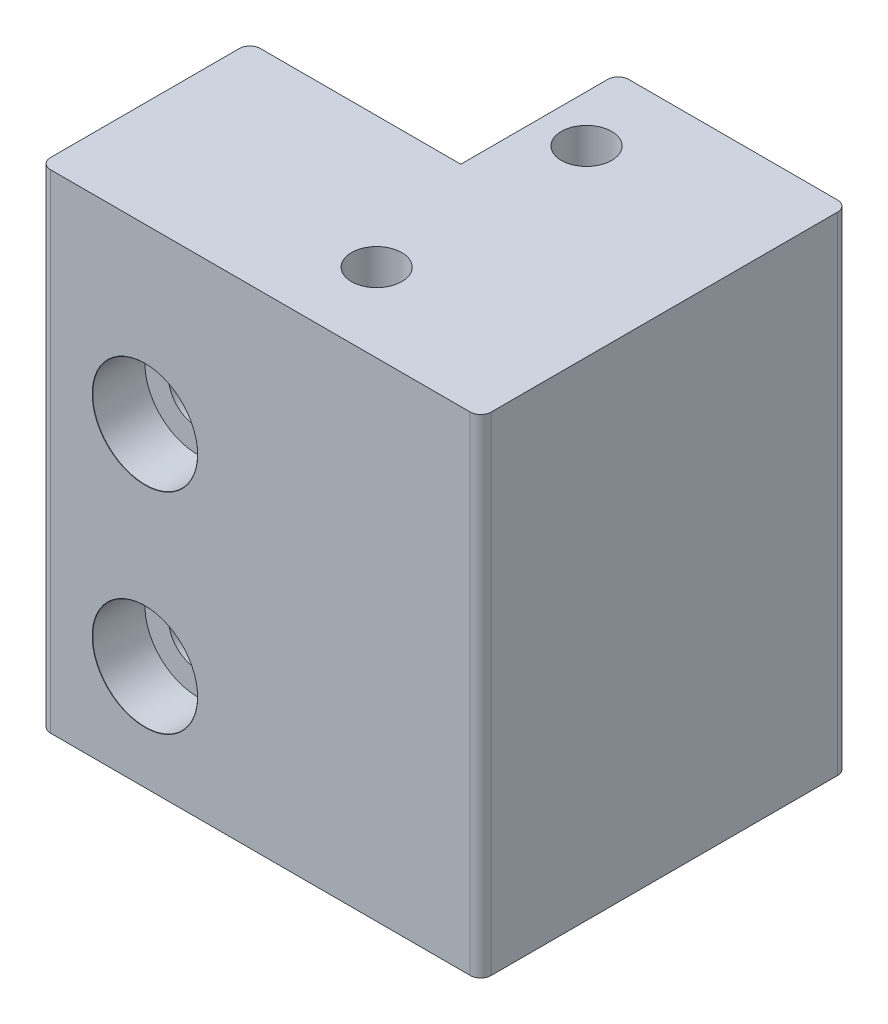
ISO-10303-21;
HEADER;
FILE_DESCRIPTION(('STEP AP214'),'2;1');
FILE_NAME('part.step','',(''),(''),'','','');
FILE_SCHEMA(('AUTOMOTIVE_DESIGN { 1 0 10303 214 1 1 1 1 }'));
ENDSEC;
DATA;
#1=APPLICATION_CONTEXT('core data for automotive mechanical design processes');
#2=APPLICATION_PROTOCOL_DEFINITION('international standard','automotive_design',2000,#1);
#3=PRODUCT_CONTEXT('',#1,'mechanical');
#4=PRODUCT('Part','Part','',(#3));
#5=PRODUCT_RELATED_PRODUCT_CATEGORY('part','',(#4));
#6=PRODUCT_DEFINITION_FORMATION('','',#4);
#7=PRODUCT_DEFINITION_CONTEXT('part definition',#1,'design');
#8=PRODUCT_DEFINITION('design','',#6,#7);
#9=PRODUCT_DEFINITION_SHAPE('','',#8);
#10=(LENGTH_UNIT() NAMED_UNIT(*) SI_UNIT(.MILLI.,.METRE.));
#11=(NAMED_UNIT(*) PLANE_ANGLE_UNIT() SI_UNIT($,.RADIAN.));
#12=(NAMED_UNIT(*) SI_UNIT($,.STERADIAN.) SOLID_ANGLE_UNIT());
#13=UNCERTAINTY_MEASURE_WITH_UNIT(LENGTH_MEASURE(1.E-05),#10,'distance_accuracy_value','');
#14=(GEOMETRIC_REPRESENTATION_CONTEXT(3) GLOBAL_UNCERTAINTY_ASSIGNED_CONTEXT((#13)) GLOBAL_UNIT_ASSIGNED_CONTEXT((#10,
#11,#12)) REPRESENTATION_CONTEXT('',''));
#15=CARTESIAN_POINT('',(0.,0.,0.));
#16=DIRECTION('',(0.,0.,1.));
#17=DIRECTION('',(1.,0.,0.));
#18=AXIS2_PLACEMENT_3D('',#15,#16,#17);
#19=CARTESIAN_POINT('',(21.,40.,-10.));
#20=DIRECTION('',(0.,0.,1.));
#21=DIRECTION('',(1.,0.,0.));
#22=AXIS2_PLACEMENT_3D('',#19,#20,#21);
#23=PLANE('',#22);
#24=CARTESIAN_POINT('',(-11.,30.,-10.));
#25=DIRECTION('',(0.,0.,1.));
#26=DIRECTION('',(1.,0.,0.));
#27=AXIS2_PLACEMENT_3D('',#24,#25,#26);
#28=CIRCLE('',#27,2.74999999999999);
#29=CARTESIAN_POINT('',(-8.25,30.,-10.));
#30=VERTEX_POINT('',#29);
#31=EDGE_CURVE('E179',#30,#30,#28,.T.);
#32=ORIENTED_EDGE('',*,*,#31,.T.);
#33=EDGE_LOOP('',(#32));
#34=FACE_BOUND('',#33,.T.);
#35=CARTESIAN_POINT('',(-11.,10.,-10.));
#36=DIRECTION('',(0.,0.,1.));
#37=DIRECTION('',(1.,0.,0.));
#38=AXIS2_PLACEMENT_3D('',#35,#36,#37);
#39=CIRCLE('',#38,2.74999999999999);
#40=CARTESIAN_POINT('',(-8.25,10.,-10.));
#41=VERTEX_POINT('',#40);
#42=EDGE_CURVE('E192',#41,#41,#39,.T.);
#43=ORIENTED_EDGE('',*,*,#42,.T.);
#44=EDGE_LOOP('',(#43));
#45=FACE_BOUND('',#44,.T.);
#46=DIRECTION('',(-1.,0.,0.));
#47=VECTOR('',#46,1.);
#48=CARTESIAN_POINT('',(21.,0.,-10.));
#49=LINE('',#48,#47);
#50=CARTESIAN_POINT('',(-0.900000000000001,0.,-10.));
#51=VERTEX_POINT('',#50);
#52=CARTESIAN_POINT('',(-20.,0.,-10.));
#53=VERTEX_POINT('',#52);
#54=EDGE_CURVE('E204',#51,#53,#49,.T.);
#55=ORIENTED_EDGE('',*,*,#54,.T.);
#56=DIRECTION('',(0.,-1.,0.));
#57=VECTOR('',#56,1.);
#58=CARTESIAN_POINT('',(-20.,40.,-10.));
#59=LINE('',#58,#57);
#60=CARTESIAN_POINT('',(-20.,46.5,-10.));
#61=VERTEX_POINT('',#60);
#62=EDGE_CURVE('E11',#53,#61,#59,.F.);
#63=ORIENTED_EDGE('',*,*,#62,.T.);
#64=DIRECTION('',(-1.,0.,0.));
#65=VECTOR('',#64,1.);
#66=CARTESIAN_POINT('',(-0.900000000000001,46.5,-10.));
#67=LINE('',#66,#65);
#68=CARTESIAN_POINT('',(-0.900000000000001,46.5,-10.));
#69=VERTEX_POINT('',#68);
#70=EDGE_CURVE('E130',#69,#61,#67,.T.);
#71=ORIENTED_EDGE('',*,*,#70,.F.);
#72=DIRECTION('',(0.,1.,0.));
#73=VECTOR('',#72,1.);
#74=CARTESIAN_POINT('',(-0.900000000000001,-26.5444909538684,-10.));
#75=LINE('',#74,#73);
#76=EDGE_CURVE('E139',#51,#69,#75,.T.);
#77=ORIENTED_EDGE('',*,*,#76,.F.);
#78=EDGE_LOOP('',(#55,#63,#71,#77));
#79=FACE_BOUND('',#78,.T.);
#80=ADVANCED_FACE('F41',(#34,#45,#79),#23,.F.);
#81=CARTESIAN_POINT('',(-21.,40.,-10.));
#82=DIRECTION('',(1.,0.,0.));
#83=DIRECTION('',(0.,0.,-1.));
#84=AXIS2_PLACEMENT_3D('',#81,#82,#83);
#85=PLANE('',#84);
#86=DIRECTION('',(0.,0.,1.));
#87=VECTOR('',#86,1.);
#88=CARTESIAN_POINT('',(-21.,46.5,-10.));
#89=LINE('',#88,#87);
#90=CARTESIAN_POINT('',(-21.,46.5,-9.));
#91=VERTEX_POINT('',#90);
#92=CARTESIAN_POINT('',(-21.,46.5,9.));
#93=VERTEX_POINT('',#92);
#94=EDGE_CURVE('E149',#91,#93,#89,.T.);
#95=ORIENTED_EDGE('',*,*,#94,.F.);
#96=DIRECTION('',(0.,-1.,0.));
#97=VECTOR('',#96,1.);
#98=CARTESIAN_POINT('',(-21.,40.,-9.));
#99=LINE('',#98,#97);
#100=CARTESIAN_POINT('',(-21.,0.,-9.));
#101=VERTEX_POINT('',#100);
#102=EDGE_CURVE('E49',#91,#101,#99,.T.);
#103=ORIENTED_EDGE('',*,*,#102,.T.);
#104=DIRECTION('',(0.,0.,1.));
#105=VECTOR('',#104,1.);
#106=CARTESIAN_POINT('',(-21.,0.,-10.));
#107=LINE('',#106,#105);
#108=CARTESIAN_POINT('',(-21.,0.,9.));
#109=VERTEX_POINT('',#108);
#110=EDGE_CURVE('E146',#101,#109,#107,.T.);
#111=ORIENTED_EDGE('',*,*,#110,.T.);
#112=DIRECTION('',(0.,-1.,0.));
#113=VECTOR('',#112,1.);
#114=CARTESIAN_POINT('',(-21.,40.,9.));
#115=LINE('',#114,#113);
#116=EDGE_CURVE('E244',#109,#93,#115,.F.);
#117=ORIENTED_EDGE('',*,*,#116,.T.);
#118=EDGE_LOOP('',(#95,#103,#111,#117));
#119=FACE_BOUND('',#118,.T.);
#120=ADVANCED_FACE('F250',(#119),#85,.F.);
#121=CARTESIAN_POINT('',(21.,40.,10.));
#122=DIRECTION('',(0.,0.,-1.));
#123=DIRECTION('',(-1.,0.,0.));
#124=AXIS2_PLACEMENT_3D('',#121,#122,#123);
#125=PLANE('',#124);
#126=CARTESIAN_POINT('',(-11.,30.,10.));
#127=DIRECTION('',(0.,0.,1.));
#128=DIRECTION('',(1.,0.,0.));
#129=AXIS2_PLACEMENT_3D('',#126,#127,#128);
#130=CIRCLE('',#129,5.025);
#131=CARTESIAN_POINT('',(-5.975,30.,10.));
#132=VERTEX_POINT('',#131);
#133=EDGE_CURVE('E135',#132,#132,#130,.T.);
#134=ORIENTED_EDGE('',*,*,#133,.F.);
#135=EDGE_LOOP('',(#134));
#136=FACE_BOUND('',#135,.T.);
#137=CARTESIAN_POINT('',(-11.,10.,10.));
#138=DIRECTION('',(0.,0.,1.));
#139=DIRECTION('',(1.,0.,0.));
#140=AXIS2_PLACEMENT_3D('',#137,#138,#139);
#141=CIRCLE('',#140,5.025);
#142=CARTESIAN_POINT('',(-5.975,10.,10.));
#143=VERTEX_POINT('',#142);
#144=EDGE_CURVE('E180',#143,#143,#141,.T.);
#145=ORIENTED_EDGE('',*,*,#144,.F.);
#146=EDGE_LOOP('',(#145));
#147=FACE_BOUND('',#146,.T.);
#148=DIRECTION('',(1.,0.,0.));
#149=VECTOR('',#148,1.);
#150=CARTESIAN_POINT('',(21.,0.,10.));
#151=LINE('',#150,#149);
#152=CARTESIAN_POINT('',(-20.,0.,10.));
#153=VERTEX_POINT('',#152);
#154=CARTESIAN_POINT('',(20.,0.,10.));
#155=VERTEX_POINT('',#154);
#156=EDGE_CURVE('E199',#153,#155,#151,.T.);
#157=ORIENTED_EDGE('',*,*,#156,.T.);
#158=DIRECTION('',(0.,-1.,0.));
#159=VECTOR('',#158,1.);
#160=CARTESIAN_POINT('',(20.,40.,10.));
#161=LINE('',#160,#159);
#162=CARTESIAN_POINT('',(20.,46.5,10.));
#163=VERTEX_POINT('',#162);
#164=EDGE_CURVE('E242',#155,#163,#161,.F.);
#165=ORIENTED_EDGE('',*,*,#164,.T.);
#166=DIRECTION('',(1.,0.,0.));
#167=VECTOR('',#166,1.);
#168=CARTESIAN_POINT('',(-21.,46.5,10.));
#169=LINE('',#168,#167);
#170=CARTESIAN_POINT('',(-20.,46.5,10.));
#171=VERTEX_POINT('',#170);
#172=EDGE_CURVE('E153',#171,#163,#169,.T.);
#173=ORIENTED_EDGE('',*,*,#172,.F.);
#174=DIRECTION('',(0.,-1.,0.));
#175=VECTOR('',#174,1.);
#176=CARTESIAN_POINT('',(-20.,40.,10.));
#177=LINE('',#176,#175);
#178=EDGE_CURVE('E240',#171,#153,#177,.T.);
#179=ORIENTED_EDGE('',*,*,#178,.T.);
#180=EDGE_LOOP('',(#157,#165,#173,#179));
#181=FACE_BOUND('',#180,.T.);
#182=ADVANCED_FACE('F255',(#136,#147,#181),#125,.F.);
#183=CARTESIAN_POINT('',(21.,40.,-10.));
#184=DIRECTION('',(-1.,0.,0.));
#185=DIRECTION('',(0.,0.,1.));
#186=AXIS2_PLACEMENT_3D('',#183,#184,#185);
#187=PLANE('',#186);
#188=DIRECTION('',(0.,0.,-1.));
#189=VECTOR('',#188,1.);
#190=CARTESIAN_POINT('',(21.,0.,-10.));
#191=LINE('',#190,#189);
#192=CARTESIAN_POINT('',(21.,0.,9.));
#193=VERTEX_POINT('',#192);
#194=CARTESIAN_POINT('',(21.,0.,-24.));
#195=VERTEX_POINT('',#194);
#196=EDGE_CURVE('E201',#193,#195,#191,.T.);
#197=ORIENTED_EDGE('',*,*,#196,.T.);
#198=DIRECTION('',(0.,1.,0.));
#199=VECTOR('',#198,1.);
#200=CARTESIAN_POINT('',(21.,46.5,-24.));
#201=LINE('',#200,#199);
#202=CARTESIAN_POINT('',(21.,46.5,-24.));
#203=VERTEX_POINT('',#202);
#204=EDGE_CURVE('E237',#195,#203,#201,.T.);
#205=ORIENTED_EDGE('',*,*,#204,.T.);
#206=DIRECTION('',(0.,0.,-1.));
#207=VECTOR('',#206,1.);
#208=CARTESIAN_POINT('',(21.,46.5,10.));
#209=LINE('',#208,#207);
#210=CARTESIAN_POINT('',(21.,46.5,9.));
#211=VERTEX_POINT('',#210);
#212=EDGE_CURVE('E164',#211,#203,#209,.T.);
#213=ORIENTED_EDGE('',*,*,#212,.F.);
#214=DIRECTION('',(0.,-1.,0.));
#215=VECTOR('',#214,1.);
#216=CARTESIAN_POINT('',(21.,40.,9.));
#217=LINE('',#216,#215);
#218=EDGE_CURVE('E234',#211,#193,#217,.T.);
#219=ORIENTED_EDGE('',*,*,#218,.T.);
#220=EDGE_LOOP('',(#197,#205,#213,#219));
#221=FACE_BOUND('',#220,.T.);
#222=ADVANCED_FACE('F263',(#221),#187,.F.);
#223=CARTESIAN_POINT('',(0.,0.,0.));
#224=DIRECTION('',(0.,-1.,0.));
#225=DIRECTION('',(0.,0.,-1.));
#226=AXIS2_PLACEMENT_3D('',#223,#224,#225);
#227=PLANE('',#226);
#228=DIRECTION('',(0.,0.,1.));
#229=VECTOR('',#228,1.);
#230=CARTESIAN_POINT('',(-0.900000000000001,0.,-10.));
#231=LINE('',#230,#229);
#232=CARTESIAN_POINT('',(-0.900000000000001,0.,-24.));
#233=VERTEX_POINT('',#232);
#234=EDGE_CURVE('E142',#233,#51,#231,.T.);
#235=ORIENTED_EDGE('',*,*,#234,.F.);
#236=CARTESIAN_POINT('',(0.0999999999999994,0.,-24.));
#237=DIRECTION('',(0.,-1.,0.));
#238=DIRECTION('',(0.,0.,-1.));
#239=AXIS2_PLACEMENT_3D('',#236,#237,#238);
#240=CIRCLE('',#239,1.);
#241=CARTESIAN_POINT('',(0.0999999999999994,0.,-25.));
#242=VERTEX_POINT('',#241);
#243=EDGE_CURVE('E232',#233,#242,#240,.T.);
#244=ORIENTED_EDGE('',*,*,#243,.T.);
#245=DIRECTION('',(-1.,0.,0.));
#246=VECTOR('',#245,1.);
#247=CARTESIAN_POINT('',(21.,0.,-25.));
#248=LINE('',#247,#246);
#249=CARTESIAN_POINT('',(20.,0.,-25.));
#250=VERTEX_POINT('',#249);
#251=EDGE_CURVE('E193',#250,#242,#248,.T.);
#252=ORIENTED_EDGE('',*,*,#251,.F.);
#253=CARTESIAN_POINT('',(20.,0.,-24.));
#254=DIRECTION('',(0.,-1.,0.));
#255=DIRECTION('',(0.,0.,-1.));
#256=AXIS2_PLACEMENT_3D('',#253,#254,#255);
#257=CIRCLE('',#256,1.);
#258=EDGE_CURVE('E230',#250,#195,#257,.T.);
#259=ORIENTED_EDGE('',*,*,#258,.T.);
#260=ORIENTED_EDGE('',*,*,#196,.F.);
#261=CARTESIAN_POINT('',(20.,0.,9.));
#262=DIRECTION('',(0.,-1.,0.));
#263=DIRECTION('',(0.,0.,-1.));
#264=AXIS2_PLACEMENT_3D('',#261,#262,#263);
#265=CIRCLE('',#264,1.);
#266=EDGE_CURVE('E56',#193,#155,#265,.T.);
#267=ORIENTED_EDGE('',*,*,#266,.T.);
#268=ORIENTED_EDGE('',*,*,#156,.F.);
#269=CARTESIAN_POINT('',(-20.,0.,9.));
#270=DIRECTION('',(0.,-1.,0.));
#271=DIRECTION('',(0.,0.,-1.));
#272=AXIS2_PLACEMENT_3D('',#269,#270,#271);
#273=CIRCLE('',#272,1.);
#274=EDGE_CURVE('E64',#153,#109,#273,.T.);
#275=ORIENTED_EDGE('',*,*,#274,.T.);
#276=ORIENTED_EDGE('',*,*,#110,.F.);
#277=CARTESIAN_POINT('',(-20.,0.,-9.));
#278=DIRECTION('',(0.,-1.,0.));
#279=DIRECTION('',(0.,0.,-1.));
#280=AXIS2_PLACEMENT_3D('',#277,#278,#279);
#281=CIRCLE('',#280,1.);
#282=EDGE_CURVE('E227',#101,#53,#281,.T.);
#283=ORIENTED_EDGE('',*,*,#282,.T.);
#284=ORIENTED_EDGE('',*,*,#54,.F.);
#285=EDGE_LOOP('',(#235,#244,#252,#259,#260,#267,#268,#275,#276,#283,#284));
#286=FACE_BOUND('',#285,.T.);
#287=ADVANCED_FACE('F252',(#286),#227,.T.);
#288=CARTESIAN_POINT('',(21.,-26.5444909538684,-25.));
#289=DIRECTION('',(0.,0.,-1.));
#290=DIRECTION('',(-1.,0.,0.));
#291=AXIS2_PLACEMENT_3D('',#288,#289,#290);
#292=PLANE('',#291);
#293=ORIENTED_EDGE('',*,*,#251,.T.);
#294=DIRECTION('',(0.,1.,0.));
#295=VECTOR('',#294,1.);
#296=CARTESIAN_POINT('',(0.0999999999999994,-26.5444909538684,-25.));
#297=LINE('',#296,#295);
#298=CARTESIAN_POINT('',(0.0999999999999994,46.5,-25.));
#299=VERTEX_POINT('',#298);
#300=EDGE_CURVE('E212',#242,#299,#297,.T.);
#301=ORIENTED_EDGE('',*,*,#300,.T.);
#302=DIRECTION('',(-1.,0.,0.));
#303=VECTOR('',#302,1.);
#304=CARTESIAN_POINT('',(21.,46.5,-25.));
#305=LINE('',#304,#303);
#306=CARTESIAN_POINT('',(20.,46.5,-25.));
#307=VERTEX_POINT('',#306);
#308=EDGE_CURVE('E136',#307,#299,#305,.T.);
#309=ORIENTED_EDGE('',*,*,#308,.F.);
#310=DIRECTION('',(0.,1.,0.));
#311=VECTOR('',#310,1.);
#312=CARTESIAN_POINT('',(20.,0.,-25.));
#313=LINE('',#312,#311);
#314=EDGE_CURVE('E206',#307,#250,#313,.F.);
#315=ORIENTED_EDGE('',*,*,#314,.T.);
#316=EDGE_LOOP('',(#293,#301,#309,#315));
#317=FACE_BOUND('',#316,.T.);
#318=ADVANCED_FACE('F271',(#317),#292,.T.);
#319=CARTESIAN_POINT('',(-0.900000000000001,-26.5444909538684,-10.));
#320=DIRECTION('',(-1.,0.,0.));
#321=DIRECTION('',(0.,0.,1.));
#322=AXIS2_PLACEMENT_3D('',#319,#320,#321);
#323=PLANE('',#322);
#324=DIRECTION('',(0.,0.,1.));
#325=VECTOR('',#324,1.);
#326=CARTESIAN_POINT('',(-0.900000000000001,46.5,-25.));
#327=LINE('',#326,#325);
#328=CARTESIAN_POINT('',(-0.900000000000001,46.5,-24.));
#329=VERTEX_POINT('',#328);
#330=EDGE_CURVE('E125',#329,#69,#327,.T.);
#331=ORIENTED_EDGE('',*,*,#330,.F.);
#332=DIRECTION('',(0.,1.,0.));
#333=VECTOR('',#332,1.);
#334=CARTESIAN_POINT('',(-0.900000000000001,-26.5444909538684,-24.));
#335=LINE('',#334,#333);
#336=EDGE_CURVE('E224',#329,#233,#335,.F.);
#337=ORIENTED_EDGE('',*,*,#336,.T.);
#338=ORIENTED_EDGE('',*,*,#234,.T.);
#339=ORIENTED_EDGE('',*,*,#76,.T.);
#340=EDGE_LOOP('',(#331,#337,#338,#339));
#341=FACE_BOUND('',#340,.T.);
#342=ADVANCED_FACE('F140',(#341),#323,.T.);
#343=CARTESIAN_POINT('',(-11.,10.,10.));
#344=DIRECTION('',(0.,0.,1.));
#345=DIRECTION('',(1.,0.,0.));
#346=AXIS2_PLACEMENT_3D('',#343,#344,#345);
#347=CYLINDRICAL_SURFACE('',#346,2.74999999999999);
#348=CARTESIAN_POINT('',(-11.,10.,5.));
#349=DIRECTION('',(0.,0.,1.));
#350=DIRECTION('',(1.,0.,0.));
#351=AXIS2_PLACEMENT_3D('',#348,#349,#350);
#352=CIRCLE('',#351,2.75);
#353=CARTESIAN_POINT('',(-8.25,10.,5.));
#354=VERTEX_POINT('',#353);
#355=EDGE_CURVE('E189',#354,#354,#352,.T.);
#356=ORIENTED_EDGE('',*,*,#355,.T.);
#357=EDGE_LOOP('',(#356));
#358=FACE_BOUND('',#357,.T.);
#359=ORIENTED_EDGE('',*,*,#42,.F.);
#360=EDGE_LOOP('',(#359));
#361=FACE_BOUND('',#360,.T.);
#362=ADVANCED_FACE('F514',(#358,#361),#347,.F.);
#363=CARTESIAN_POINT('',(-6.,10.,5.));
#364=DIRECTION('',(0.,0.,-1.));
#365=DIRECTION('',(-1.,0.,0.));
#366=AXIS2_PLACEMENT_3D('',#363,#364,#365);
#367=PLANE('',#366);
#368=ORIENTED_EDGE('',*,*,#355,.F.);
#369=EDGE_LOOP('',(#368));
#370=FACE_BOUND('',#369,.T.);
#371=CARTESIAN_POINT('',(-11.,10.,5.));
#372=DIRECTION('',(0.,0.,1.));
#373=DIRECTION('',(1.,0.,0.));
#374=AXIS2_PLACEMENT_3D('',#371,#372,#373);
#375=CIRCLE('',#374,5.);
#376=CARTESIAN_POINT('',(-6.,10.,5.));
#377=VERTEX_POINT('',#376);
#378=EDGE_CURVE('E186',#377,#377,#375,.T.);
#379=ORIENTED_EDGE('',*,*,#378,.T.);
#380=EDGE_LOOP('',(#379));
#381=FACE_BOUND('',#380,.T.);
#382=ADVANCED_FACE('F504',(#370,#381),#367,.F.);
#383=CARTESIAN_POINT('',(-11.,10.,10.));
#384=DIRECTION('',(0.,0.,1.));
#385=DIRECTION('',(1.,0.,0.));
#386=AXIS2_PLACEMENT_3D('',#383,#384,#385);
#387=CYLINDRICAL_SURFACE('',#386,5.);
#388=ORIENTED_EDGE('',*,*,#378,.F.);
#389=EDGE_LOOP('',(#388));
#390=FACE_BOUND('',#389,.T.);
#391=CARTESIAN_POINT('',(-11.,10.,9.97902250922056));
#392=DIRECTION('',(0.,0.,1.));
#393=DIRECTION('',(1.,0.,0.));
#394=AXIS2_PLACEMENT_3D('',#391,#392,#393);
#395=CIRCLE('',#394,5.);
#396=CARTESIAN_POINT('',(-6.,10.,9.97902250922056));
#397=VERTEX_POINT('',#396);
#398=EDGE_CURVE('E183',#397,#397,#395,.T.);
#399=ORIENTED_EDGE('',*,*,#398,.T.);
#400=EDGE_LOOP('',(#399));
#401=FACE_BOUND('',#400,.T.);
#402=ADVANCED_FACE('F494',(#390,#401),#387,.F.);
#403=CARTESIAN_POINT('',(-11.,10.,10.));
#404=DIRECTION('',(0.,0.,1.));
#405=DIRECTION('',(1.,0.,0.));
#406=AXIS2_PLACEMENT_3D('',#403,#404,#405);
#407=CONICAL_SURFACE('',#406,5.025,0.872664625997152);
#408=ORIENTED_EDGE('',*,*,#398,.F.);
#409=EDGE_LOOP('',(#408));
#410=FACE_BOUND('',#409,.T.);
#411=ORIENTED_EDGE('',*,*,#144,.T.);
#412=EDGE_LOOP('',(#411));
#413=FACE_BOUND('',#412,.T.);
#414=ADVANCED_FACE('F484',(#410,#413),#407,.F.);
#415=CARTESIAN_POINT('',(-11.,30.,10.));
#416=DIRECTION('',(0.,0.,1.));
#417=DIRECTION('',(1.,0.,0.));
#418=AXIS2_PLACEMENT_3D('',#415,#416,#417);
#419=CYLINDRICAL_SURFACE('',#418,2.74999999999999);
#420=CARTESIAN_POINT('',(-11.,30.,5.));
#421=DIRECTION('',(0.,0.,1.));
#422=DIRECTION('',(1.,0.,0.));
#423=AXIS2_PLACEMENT_3D('',#420,#421,#422);
#424=CIRCLE('',#423,2.75);
#425=CARTESIAN_POINT('',(-8.25,30.,5.));
#426=VERTEX_POINT('',#425);
#427=EDGE_CURVE('E176',#426,#426,#424,.T.);
#428=ORIENTED_EDGE('',*,*,#427,.T.);
#429=EDGE_LOOP('',(#428));
#430=FACE_BOUND('',#429,.T.);
#431=ORIENTED_EDGE('',*,*,#31,.F.);
#432=EDGE_LOOP('',(#431));
#433=FACE_BOUND('',#432,.T.);
#434=ADVANCED_FACE('F474',(#430,#433),#419,.F.);
#435=CARTESIAN_POINT('',(-6.,30.,5.));
#436=DIRECTION('',(0.,0.,-1.));
#437=DIRECTION('',(-1.,0.,0.));
#438=AXIS2_PLACEMENT_3D('',#435,#436,#437);
#439=PLANE('',#438);
#440=ORIENTED_EDGE('',*,*,#427,.F.);
#441=EDGE_LOOP('',(#440));
#442=FACE_BOUND('',#441,.T.);
#443=CARTESIAN_POINT('',(-11.,30.,5.));
#444=DIRECTION('',(0.,0.,1.));
#445=DIRECTION('',(1.,0.,0.));
#446=AXIS2_PLACEMENT_3D('',#443,#444,#445);
#447=CIRCLE('',#446,5.);
#448=CARTESIAN_POINT('',(-6.,30.,5.));
#449=VERTEX_POINT('',#448);
#450=EDGE_CURVE('E173',#449,#449,#447,.T.);
#451=ORIENTED_EDGE('',*,*,#450,.T.);
#452=EDGE_LOOP('',(#451));
#453=FACE_BOUND('',#452,.T.);
#454=ADVANCED_FACE('F464',(#442,#453),#439,.F.);
#455=CARTESIAN_POINT('',(-11.,30.,10.));
#456=DIRECTION('',(0.,0.,1.));
#457=DIRECTION('',(1.,0.,0.));
#458=AXIS2_PLACEMENT_3D('',#455,#456,#457);
#459=CYLINDRICAL_SURFACE('',#458,5.);
#460=ORIENTED_EDGE('',*,*,#450,.F.);
#461=EDGE_LOOP('',(#460));
#462=FACE_BOUND('',#461,.T.);
#463=CARTESIAN_POINT('',(-11.,30.,9.97902250922056));
#464=DIRECTION('',(0.,0.,1.));
#465=DIRECTION('',(1.,0.,0.));
#466=AXIS2_PLACEMENT_3D('',#463,#464,#465);
#467=CIRCLE('',#466,5.);
#468=CARTESIAN_POINT('',(-6.,30.,9.97902250922056));
#469=VERTEX_POINT('',#468);
#470=EDGE_CURVE('E170',#469,#469,#467,.T.);
#471=ORIENTED_EDGE('',*,*,#470,.T.);
#472=EDGE_LOOP('',(#471));
#473=FACE_BOUND('',#472,.T.);
#474=ADVANCED_FACE('F453',(#462,#473),#459,.F.);
#475=CARTESIAN_POINT('',(-11.,30.,10.));
#476=DIRECTION('',(0.,0.,1.));
#477=DIRECTION('',(1.,0.,0.));
#478=AXIS2_PLACEMENT_3D('',#475,#476,#477);
#479=CONICAL_SURFACE('',#478,5.025,0.872664625997152);
#480=ORIENTED_EDGE('',*,*,#470,.F.);
#481=EDGE_LOOP('',(#480));
#482=FACE_BOUND('',#481,.T.);
#483=ORIENTED_EDGE('',*,*,#133,.T.);
#484=EDGE_LOOP('',(#483));
#485=FACE_BOUND('',#484,.T.);
#486=ADVANCED_FACE('F333',(#482,#485),#479,.F.);
#487=CARTESIAN_POINT('',(0.,46.5,0.));
#488=DIRECTION('',(0.,1.,0.));
#489=DIRECTION('',(0.,0.,1.));
#490=AXIS2_PLACEMENT_3D('',#487,#488,#489);
#491=PLANE('',#490);
#492=CARTESIAN_POINT('',(3.57999999999999,46.5,-17.5));
#493=DIRECTION('',(0.,1.,0.));
#494=DIRECTION('',(0.,0.,1.));
#495=AXIS2_PLACEMENT_3D('',#492,#493,#494);
#496=CIRCLE('',#495,2.4);
#497=CARTESIAN_POINT('',(3.57999999999999,46.5,-15.1));
#498=VERTEX_POINT('',#497);
#499=EDGE_CURVE('E156',#498,#498,#496,.T.);
#500=ORIENTED_EDGE('',*,*,#499,.F.);
#501=EDGE_LOOP('',(#500));
#502=FACE_BOUND('',#501,.T.);
#503=CARTESIAN_POINT('',(3.58,46.5,2.5));
#504=DIRECTION('',(0.,1.,0.));
#505=DIRECTION('',(0.,0.,1.));
#506=AXIS2_PLACEMENT_3D('',#503,#504,#505);
#507=CIRCLE('',#506,2.4);
#508=CARTESIAN_POINT('',(3.58,46.5,4.9));
#509=VERTEX_POINT('',#508);
#510=EDGE_CURVE('E657',#509,#509,#507,.T.);
#511=ORIENTED_EDGE('',*,*,#510,.F.);
#512=EDGE_LOOP('',(#511));
#513=FACE_BOUND('',#512,.T.);
#514=ORIENTED_EDGE('',*,*,#308,.T.);
#515=CARTESIAN_POINT('',(0.0999999999999994,46.5,-24.));
#516=DIRECTION('',(0.,1.,0.));
#517=DIRECTION('',(0.,0.,1.));
#518=AXIS2_PLACEMENT_3D('',#515,#516,#517);
#519=CIRCLE('',#518,1.);
#520=EDGE_CURVE('E132',#299,#329,#519,.T.);
#521=ORIENTED_EDGE('',*,*,#520,.T.);
#522=ORIENTED_EDGE('',*,*,#330,.T.);
#523=ORIENTED_EDGE('',*,*,#70,.T.);
#524=CARTESIAN_POINT('',(-20.,46.5,-9.));
#525=DIRECTION('',(0.,1.,0.));
#526=DIRECTION('',(0.,0.,1.));
#527=AXIS2_PLACEMENT_3D('',#524,#525,#526);
#528=CIRCLE('',#527,1.);
#529=EDGE_CURVE('E217',#61,#91,#528,.T.);
#530=ORIENTED_EDGE('',*,*,#529,.T.);
#531=ORIENTED_EDGE('',*,*,#94,.T.);
#532=CARTESIAN_POINT('',(-20.,46.5,9.));
#533=DIRECTION('',(0.,1.,0.));
#534=DIRECTION('',(0.,0.,1.));
#535=AXIS2_PLACEMENT_3D('',#532,#533,#534);
#536=CIRCLE('',#535,1.);
#537=EDGE_CURVE('E215',#93,#171,#536,.T.);
#538=ORIENTED_EDGE('',*,*,#537,.T.);
#539=ORIENTED_EDGE('',*,*,#172,.T.);
#540=CARTESIAN_POINT('',(20.,46.5,9.));
#541=DIRECTION('',(0.,1.,0.));
#542=DIRECTION('',(0.,0.,1.));
#543=AXIS2_PLACEMENT_3D('',#540,#541,#542);
#544=CIRCLE('',#543,1.);
#545=EDGE_CURVE('E219',#163,#211,#544,.T.);
#546=ORIENTED_EDGE('',*,*,#545,.T.);
#547=ORIENTED_EDGE('',*,*,#212,.T.);
#548=CARTESIAN_POINT('',(20.,46.5,-24.));
#549=DIRECTION('',(0.,1.,0.));
#550=DIRECTION('',(0.,0.,1.));
#551=AXIS2_PLACEMENT_3D('',#548,#549,#550);
#552=CIRCLE('',#551,1.);
#553=EDGE_CURVE('E221',#203,#307,#552,.T.);
#554=ORIENTED_EDGE('',*,*,#553,.T.);
#555=EDGE_LOOP('',(#514,#521,#522,#523,#530,#531,#538,#539,#546,#547,#554));
#556=FACE_BOUND('',#555,.T.);
#557=ADVANCED_FACE('F128',(#502,#513,#556),#491,.T.);
#558=CARTESIAN_POINT('',(0.0999999999999994,-26.5444909538684,-24.));
#559=DIRECTION('',(0.,1.,0.));
#560=DIRECTION('',(0.,0.,1.));
#561=AXIS2_PLACEMENT_3D('',#558,#559,#560);
#562=CYLINDRICAL_SURFACE('',#561,1.);
#563=ORIENTED_EDGE('',*,*,#243,.F.);
#564=ORIENTED_EDGE('',*,*,#336,.F.);
#565=ORIENTED_EDGE('',*,*,#520,.F.);
#566=ORIENTED_EDGE('',*,*,#300,.F.);
#567=EDGE_LOOP('',(#563,#564,#565,#566));
#568=FACE_BOUND('',#567,.T.);
#569=ADVANCED_FACE('F276',(#568),#562,.T.);
#570=CARTESIAN_POINT('',(20.,40.,-24.));
#571=DIRECTION('',(0.,-1.,0.));
#572=DIRECTION('',(0.,0.,-1.));
#573=AXIS2_PLACEMENT_3D('',#570,#571,#572);
#574=CYLINDRICAL_SURFACE('',#573,1.);
#575=ORIENTED_EDGE('',*,*,#258,.F.);
#576=ORIENTED_EDGE('',*,*,#314,.F.);
#577=ORIENTED_EDGE('',*,*,#553,.F.);
#578=ORIENTED_EDGE('',*,*,#204,.F.);
#579=EDGE_LOOP('',(#575,#576,#577,#578));
#580=FACE_BOUND('',#579,.T.);
#581=ADVANCED_FACE('F267',(#580),#574,.T.);
#582=CARTESIAN_POINT('',(20.,40.,9.));
#583=DIRECTION('',(0.,-1.,0.));
#584=DIRECTION('',(0.,0.,-1.));
#585=AXIS2_PLACEMENT_3D('',#582,#583,#584);
#586=CYLINDRICAL_SURFACE('',#585,1.);
#587=ORIENTED_EDGE('',*,*,#545,.F.);
#588=ORIENTED_EDGE('',*,*,#164,.F.);
#589=ORIENTED_EDGE('',*,*,#266,.F.);
#590=ORIENTED_EDGE('',*,*,#218,.F.);
#591=EDGE_LOOP('',(#587,#588,#589,#590));
#592=FACE_BOUND('',#591,.T.);
#593=ADVANCED_FACE('F259',(#592),#586,.T.);
#594=CARTESIAN_POINT('',(-20.,40.,-9.));
#595=DIRECTION('',(0.,-1.,0.));
#596=DIRECTION('',(0.,0.,-1.));
#597=AXIS2_PLACEMENT_3D('',#594,#595,#596);
#598=CYLINDRICAL_SURFACE('',#597,1.);
#599=ORIENTED_EDGE('',*,*,#529,.F.);
#600=ORIENTED_EDGE('',*,*,#62,.F.);
#601=ORIENTED_EDGE('',*,*,#282,.F.);
#602=ORIENTED_EDGE('',*,*,#102,.F.);
#603=EDGE_LOOP('',(#599,#600,#601,#602));
#604=FACE_BOUND('',#603,.T.);
#605=ADVANCED_FACE('F277',(#604),#598,.T.);
#606=CARTESIAN_POINT('',(-20.,40.,9.));
#607=DIRECTION('',(0.,-1.,0.));
#608=DIRECTION('',(0.,0.,-1.));
#609=AXIS2_PLACEMENT_3D('',#606,#607,#608);
#610=CYLINDRICAL_SURFACE('',#609,1.);
#611=ORIENTED_EDGE('',*,*,#537,.F.);
#612=ORIENTED_EDGE('',*,*,#116,.F.);
#613=ORIENTED_EDGE('',*,*,#274,.F.);
#614=ORIENTED_EDGE('',*,*,#178,.F.);
#615=EDGE_LOOP('',(#611,#612,#613,#614));
#616=FACE_BOUND('',#615,.T.);
#617=ADVANCED_FACE('F43',(#616),#610,.T.);
#618=CARTESIAN_POINT('',(3.58,42.7,2.5));
#619=DIRECTION('',(0.,1.,0.));
#620=DIRECTION('',(0.,0.,1.));
#621=AXIS2_PLACEMENT_3D('',#618,#619,#620);
#622=CYLINDRICAL_SURFACE('',#621,2.4);
#623=CARTESIAN_POINT('',(3.58,42.7,2.5));
#624=DIRECTION('',(0.,1.,0.));
#625=DIRECTION('',(0.,0.,1.));
#626=AXIS2_PLACEMENT_3D('',#623,#624,#625);
#627=CIRCLE('',#626,2.4);
#628=CARTESIAN_POINT('',(3.58,42.7,4.9));
#629=VERTEX_POINT('',#628);
#630=EDGE_CURVE('E159',#629,#629,#627,.T.);
#631=ORIENTED_EDGE('',*,*,#630,.F.);
#632=EDGE_LOOP('',(#631));
#633=FACE_BOUND('',#632,.T.);
#634=ORIENTED_EDGE('',*,*,#510,.T.);
#635=EDGE_LOOP('',(#634));
#636=FACE_BOUND('',#635,.T.);
#637=ADVANCED_FACE('F280',(#633,#636),#622,.F.);
#638=CARTESIAN_POINT('',(3.58,42.7,2.5));
#639=DIRECTION('',(0.,1.,0.));
#640=DIRECTION('',(0.,0.,1.));
#641=AXIS2_PLACEMENT_3D('',#638,#639,#640);
#642=PLANE('',#641);
#643=CARTESIAN_POINT('',(3.58,42.7,2.5));
#644=DIRECTION('',(0.,1.,0.));
#645=DIRECTION('',(0.,0.,1.));
#646=AXIS2_PLACEMENT_3D('',#643,#644,#645);
#647=CIRCLE('',#646,1.65);
#648=CARTESIAN_POINT('',(3.58,42.7,4.15));
#649=VERTEX_POINT('',#648);
#650=EDGE_CURVE('E649',#649,#649,#647,.T.);
#651=ORIENTED_EDGE('',*,*,#650,.F.);
#652=EDGE_LOOP('',(#651));
#653=FACE_BOUND('',#652,.T.);
#654=ORIENTED_EDGE('',*,*,#630,.T.);
#655=EDGE_LOOP('',(#654));
#656=FACE_BOUND('',#655,.T.);
#657=ADVANCED_FACE('F285',(#653,#656),#642,.T.);
#658=CARTESIAN_POINT('',(3.57999999999999,42.7,-17.5));
#659=DIRECTION('',(0.,1.,0.));
#660=DIRECTION('',(0.,0.,1.));
#661=AXIS2_PLACEMENT_3D('',#658,#659,#660);
#662=CYLINDRICAL_SURFACE('',#661,2.4);
#663=CARTESIAN_POINT('',(3.57999999999999,42.7,-17.5));
#664=DIRECTION('',(0.,1.,0.));
#665=DIRECTION('',(0.,0.,1.));
#666=AXIS2_PLACEMENT_3D('',#663,#664,#665);
#667=CIRCLE('',#666,2.4);
#668=CARTESIAN_POINT('',(3.57999999999999,42.7,-15.1));
#669=VERTEX_POINT('',#668);
#670=EDGE_CURVE('E150',#669,#669,#667,.T.);
#671=ORIENTED_EDGE('',*,*,#670,.F.);
#672=EDGE_LOOP('',(#671));
#673=FACE_BOUND('',#672,.T.);
#674=ORIENTED_EDGE('',*,*,#499,.T.);
#675=EDGE_LOOP('',(#674));
#676=FACE_BOUND('',#675,.T.);
#677=ADVANCED_FACE('F351',(#673,#676),#662,.F.);
#678=CARTESIAN_POINT('',(3.57999999999999,42.7,-17.5));
#679=DIRECTION('',(0.,1.,0.));
#680=DIRECTION('',(0.,0.,1.));
#681=AXIS2_PLACEMENT_3D('',#678,#679,#680);
#682=PLANE('',#681);
#683=CARTESIAN_POINT('',(3.57999999999999,42.7,-17.5));
#684=DIRECTION('',(0.,1.,0.));
#685=DIRECTION('',(0.,0.,1.));
#686=AXIS2_PLACEMENT_3D('',#683,#684,#685);
#687=CIRCLE('',#686,1.65);
#688=CARTESIAN_POINT('',(3.57999999999999,42.7,-15.85));
#689=VERTEX_POINT('',#688);
#690=EDGE_CURVE('E652',#689,#689,#687,.T.);
#691=ORIENTED_EDGE('',*,*,#690,.F.);
#692=EDGE_LOOP('',(#691));
#693=FACE_BOUND('',#692,.T.);
#694=ORIENTED_EDGE('',*,*,#670,.T.);
#695=EDGE_LOOP('',(#694));
#696=FACE_BOUND('',#695,.T.);
#697=ADVANCED_FACE('F356',(#693,#696),#682,.T.);
#698=CARTESIAN_POINT('',(3.57999999999999,39.7,-17.5));
#699=DIRECTION('',(0.,1.,0.));
#700=DIRECTION('',(0.,0.,1.));
#701=AXIS2_PLACEMENT_3D('',#698,#699,#700);
#702=CYLINDRICAL_SURFACE('',#701,1.65);
#703=CARTESIAN_POINT('',(3.57999999999999,39.7,-17.5));
#704=DIRECTION('',(0.,1.,0.));
#705=DIRECTION('',(0.,0.,1.));
#706=AXIS2_PLACEMENT_3D('',#703,#704,#705);
#707=CIRCLE('',#706,1.65);
#708=CARTESIAN_POINT('',(3.57999999999999,39.7,-15.85));
#709=VERTEX_POINT('',#708);
#710=EDGE_CURVE('E662',#709,#709,#707,.T.);
#711=ORIENTED_EDGE('',*,*,#710,.F.);
#712=EDGE_LOOP('',(#711));
#713=FACE_BOUND('',#712,.T.);
#714=ORIENTED_EDGE('',*,*,#690,.T.);
#715=EDGE_LOOP('',(#714));
#716=FACE_BOUND('',#715,.T.);
#717=ADVANCED_FACE('F375',(#713,#716),#702,.F.);
#718=CARTESIAN_POINT('',(3.57999999999999,39.7,-17.5));
#719=DIRECTION('',(0.,1.,0.));
#720=DIRECTION('',(0.,0.,1.));
#721=AXIS2_PLACEMENT_3D('',#718,#719,#720);
#722=PLANE('',#721);
#723=ORIENTED_EDGE('',*,*,#710,.T.);
#724=EDGE_LOOP('',(#723));
#725=FACE_BOUND('',#724,.T.);
#726=ADVANCED_FACE('F386',(#725),#722,.T.);
#727=CARTESIAN_POINT('',(3.58,39.7,2.5));
#728=DIRECTION('',(0.,1.,0.));
#729=DIRECTION('',(0.,0.,1.));
#730=AXIS2_PLACEMENT_3D('',#727,#728,#729);
#731=CYLINDRICAL_SURFACE('',#730,1.65);
#732=CARTESIAN_POINT('',(3.58,39.7,2.5));
#733=DIRECTION('',(0.,1.,0.));
#734=DIRECTION('',(0.,0.,1.));
#735=AXIS2_PLACEMENT_3D('',#732,#733,#734);
#736=CIRCLE('',#735,1.65);
#737=CARTESIAN_POINT('',(3.58,39.7,4.15));
#738=VERTEX_POINT('',#737);
#739=EDGE_CURVE('E648',#738,#738,#736,.T.);
#740=ORIENTED_EDGE('',*,*,#739,.F.);
#741=EDGE_LOOP('',(#740));
#742=FACE_BOUND('',#741,.T.);
#743=ORIENTED_EDGE('',*,*,#650,.T.);
#744=EDGE_LOOP('',(#743));
#745=FACE_BOUND('',#744,.T.);
#746=ADVANCED_FACE('F397',(#742,#745),#731,.F.);
#747=CARTESIAN_POINT('',(3.58,39.7,2.5));
#748=DIRECTION('',(0.,1.,0.));
#749=DIRECTION('',(0.,0.,1.));
#750=AXIS2_PLACEMENT_3D('',#747,#748,#749);
#751=PLANE('',#750);
#752=ORIENTED_EDGE('',*,*,#739,.T.);
#753=EDGE_LOOP('',(#752));
#754=FACE_BOUND('',#753,.T.);
#755=ADVANCED_FACE('F408',(#754),#751,.T.);
#756=CLOSED_SHELL('',(#80,#120,#182,#222,#287,#318,#342,#362,#382,#402,#414,#434,#454,#474,#486,
#557,#569,#581,#593,#605,#617,#637,#657,#677,#697,#717,#726,#746,#755));
#757=MANIFOLD_SOLID_BREP('B2',#756);
#758=ADVANCED_BREP_SHAPE_REPRESENTATION('',(#18,#757),#14);
#759=SHAPE_DEFINITION_REPRESENTATION(#9,#758);
ENDSEC;
END-ISO-10303-21;
